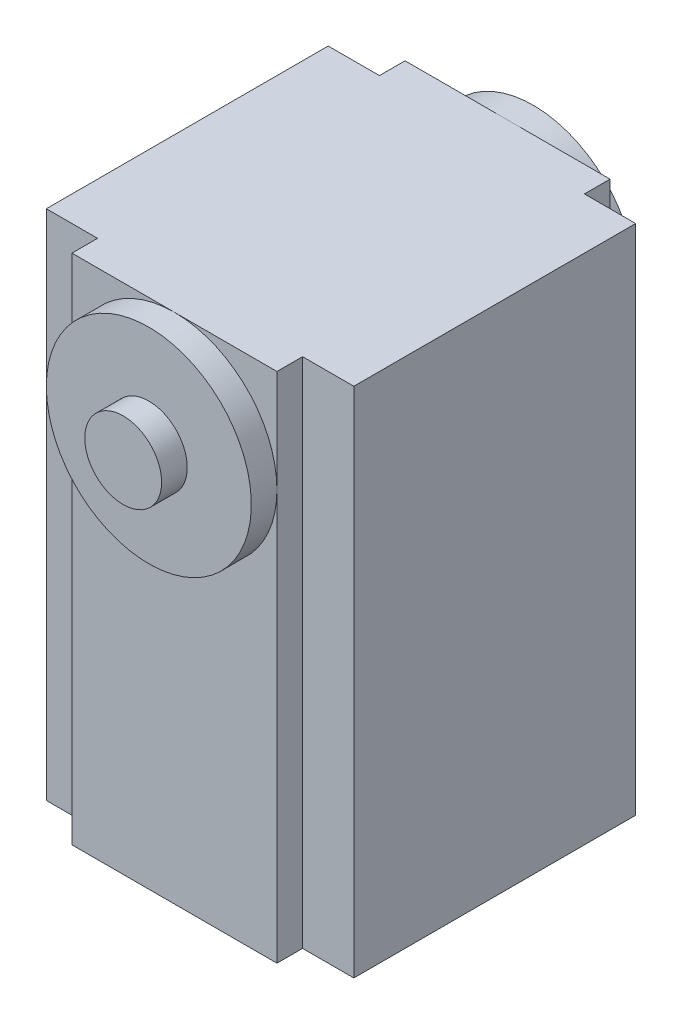
ISO-10303-21;
HEADER;
FILE_DESCRIPTION(('STEP AP214'),'2;1');
FILE_NAME('part.step','',(''),(''),'','','');
FILE_SCHEMA(('AUTOMOTIVE_DESIGN { 1 0 10303 214 1 1 1 1 }'));
ENDSEC;
DATA;
#1=APPLICATION_CONTEXT('core data for automotive mechanical design processes');
#2=APPLICATION_PROTOCOL_DEFINITION('international standard','automotive_design',2000,#1);
#3=PRODUCT_CONTEXT('',#1,'mechanical');
#4=PRODUCT('Part','Part','',(#3));
#5=PRODUCT_RELATED_PRODUCT_CATEGORY('part','',(#4));
#6=PRODUCT_DEFINITION_FORMATION('','',#4);
#7=PRODUCT_DEFINITION_CONTEXT('part definition',#1,'design');
#8=PRODUCT_DEFINITION('design','',#6,#7);
#9=PRODUCT_DEFINITION_SHAPE('','',#8);
#10=(LENGTH_UNIT() NAMED_UNIT(*) SI_UNIT(.MILLI.,.METRE.));
#11=(NAMED_UNIT(*) PLANE_ANGLE_UNIT() SI_UNIT($,.RADIAN.));
#12=(NAMED_UNIT(*) SI_UNIT($,.STERADIAN.) SOLID_ANGLE_UNIT());
#13=UNCERTAINTY_MEASURE_WITH_UNIT(LENGTH_MEASURE(1.E-05),#10,'distance_accuracy_value','');
#14=(GEOMETRIC_REPRESENTATION_CONTEXT(3) GLOBAL_UNCERTAINTY_ASSIGNED_CONTEXT((#13)) GLOBAL_UNIT_ASSIGNED_CONTEXT((#10,
#11,#12)) REPRESENTATION_CONTEXT('',''));
#15=CARTESIAN_POINT('',(0.,0.,0.));
#16=DIRECTION('',(0.,0.,1.));
#17=DIRECTION('',(1.,0.,0.));
#18=AXIS2_PLACEMENT_3D('',#15,#16,#17);
#19=CARTESIAN_POINT('',(-19.05,-31.75,41.275));
#20=DIRECTION('',(1.,0.,0.));
#21=DIRECTION('',(0.,0.,-1.));
#22=AXIS2_PLACEMENT_3D('',#19,#20,#21);
#23=PLANE('',#22);
#24=DIRECTION('',(0.,-1.,0.));
#25=VECTOR('',#24,1.);
#26=CARTESIAN_POINT('',(-19.05,31.75,3.175));
#27=LINE('',#26,#25);
#28=CARTESIAN_POINT('',(-19.05,31.75,3.175));
#29=VERTEX_POINT('',#28);
#30=CARTESIAN_POINT('',(-19.05,-31.75,3.175));
#31=VERTEX_POINT('',#30);
#32=EDGE_CURVE('E141',#29,#31,#27,.T.);
#33=ORIENTED_EDGE('',*,*,#32,.T.);
#34=DIRECTION('',(0.,0.,-1.));
#35=VECTOR('',#34,1.);
#36=CARTESIAN_POINT('',(-19.05,-31.75,41.275));
#37=LINE('',#36,#35);
#38=CARTESIAN_POINT('',(-19.05,-31.75,38.1));
#39=VERTEX_POINT('',#38);
#40=EDGE_CURVE('E37',#39,#31,#37,.T.);
#41=ORIENTED_EDGE('',*,*,#40,.F.);
#42=DIRECTION('',(0.,-1.,0.));
#43=VECTOR('',#42,1.);
#44=CARTESIAN_POINT('',(-19.05,31.75,38.1));
#45=LINE('',#44,#43);
#46=CARTESIAN_POINT('',(-19.05,31.75,38.1));
#47=VERTEX_POINT('',#46);
#48=EDGE_CURVE('E165',#47,#39,#45,.T.);
#49=ORIENTED_EDGE('',*,*,#48,.F.);
#50=DIRECTION('',(0.,0.,-1.));
#51=VECTOR('',#50,1.);
#52=CARTESIAN_POINT('',(-19.05,31.75,41.275));
#53=LINE('',#52,#51);
#54=EDGE_CURVE('E159',#47,#29,#53,.T.);
#55=ORIENTED_EDGE('',*,*,#54,.T.);
#56=EDGE_LOOP('',(#33,#41,#49,#55));
#57=FACE_BOUND('',#56,.T.);
#58=ADVANCED_FACE('F34',(#57),#23,.F.);
#59=CARTESIAN_POINT('',(19.05,-31.75,41.275));
#60=DIRECTION('',(0.,1.,0.));
#61=DIRECTION('',(-1.,0.,0.));
#62=AXIS2_PLACEMENT_3D('',#59,#60,#61);
#63=PLANE('',#62);
#64=DIRECTION('',(0.,0.,-1.));
#65=VECTOR('',#64,1.);
#66=CARTESIAN_POINT('',(-12.7,-31.75,3.175));
#67=LINE('',#66,#65);
#68=CARTESIAN_POINT('',(-12.7,-31.75,3.175));
#69=VERTEX_POINT('',#68);
#70=CARTESIAN_POINT('',(-12.7,-31.75,0.));
#71=VERTEX_POINT('',#70);
#72=EDGE_CURVE('E283',#69,#71,#67,.T.);
#73=ORIENTED_EDGE('',*,*,#72,.T.);
#74=DIRECTION('',(1.,0.,0.));
#75=VECTOR('',#74,1.);
#76=CARTESIAN_POINT('',(19.05,-31.75,0.));
#77=LINE('',#76,#75);
#78=CARTESIAN_POINT('',(12.7,-31.75,0.));
#79=VERTEX_POINT('',#78);
#80=EDGE_CURVE('E247',#71,#79,#77,.T.);
#81=ORIENTED_EDGE('',*,*,#80,.T.);
#82=DIRECTION('',(0.,0.,-1.));
#83=VECTOR('',#82,1.);
#84=CARTESIAN_POINT('',(12.7,-31.75,3.175));
#85=LINE('',#84,#83);
#86=CARTESIAN_POINT('',(12.7,-31.75,3.175));
#87=VERTEX_POINT('',#86);
#88=EDGE_CURVE('E293',#87,#79,#85,.T.);
#89=ORIENTED_EDGE('',*,*,#88,.F.);
#90=DIRECTION('',(1.,0.,0.));
#91=VECTOR('',#90,1.);
#92=CARTESIAN_POINT('',(19.05,-31.75,3.175));
#93=LINE('',#92,#91);
#94=CARTESIAN_POINT('',(19.05,-31.75,3.175));
#95=VERTEX_POINT('',#94);
#96=EDGE_CURVE('E287',#87,#95,#93,.T.);
#97=ORIENTED_EDGE('',*,*,#96,.T.);
#98=DIRECTION('',(0.,0.,-1.));
#99=VECTOR('',#98,1.);
#100=CARTESIAN_POINT('',(19.05,-31.75,41.275));
#101=LINE('',#100,#99);
#102=CARTESIAN_POINT('',(19.05,-31.75,38.1));
#103=VERTEX_POINT('',#102);
#104=EDGE_CURVE('E170',#103,#95,#101,.T.);
#105=ORIENTED_EDGE('',*,*,#104,.F.);
#106=DIRECTION('',(1.,0.,0.));
#107=VECTOR('',#106,1.);
#108=CARTESIAN_POINT('',(19.05,-31.75,38.1));
#109=LINE('',#108,#107);
#110=CARTESIAN_POINT('',(12.7,-31.75,38.1));
#111=VERTEX_POINT('',#110);
#112=EDGE_CURVE('E218',#111,#103,#109,.T.);
#113=ORIENTED_EDGE('',*,*,#112,.F.);
#114=DIRECTION('',(0.,0.,1.));
#115=VECTOR('',#114,1.);
#116=CARTESIAN_POINT('',(12.7,-31.75,38.1));
#117=LINE('',#116,#115);
#118=CARTESIAN_POINT('',(12.7,-31.75,41.275));
#119=VERTEX_POINT('',#118);
#120=EDGE_CURVE('E223',#111,#119,#117,.T.);
#121=ORIENTED_EDGE('',*,*,#120,.T.);
#122=DIRECTION('',(1.,0.,0.));
#123=VECTOR('',#122,1.);
#124=CARTESIAN_POINT('',(19.05,-31.75,41.275));
#125=LINE('',#124,#123);
#126=CARTESIAN_POINT('',(-12.7,-31.75,41.275));
#127=VERTEX_POINT('',#126);
#128=EDGE_CURVE('E252',#127,#119,#125,.T.);
#129=ORIENTED_EDGE('',*,*,#128,.F.);
#130=DIRECTION('',(0.,0.,1.));
#131=VECTOR('',#130,1.);
#132=CARTESIAN_POINT('',(-12.7,-31.75,38.1));
#133=LINE('',#132,#131);
#134=CARTESIAN_POINT('',(-12.7,-31.75,38.1));
#135=VERTEX_POINT('',#134);
#136=EDGE_CURVE('E190',#135,#127,#133,.T.);
#137=ORIENTED_EDGE('',*,*,#136,.F.);
#138=DIRECTION('',(1.,0.,0.));
#139=VECTOR('',#138,1.);
#140=CARTESIAN_POINT('',(-19.05,-31.75,38.1));
#141=LINE('',#140,#139);
#142=EDGE_CURVE('E188',#39,#135,#141,.T.);
#143=ORIENTED_EDGE('',*,*,#142,.F.);
#144=ORIENTED_EDGE('',*,*,#40,.T.);
#145=DIRECTION('',(1.,0.,0.));
#146=VECTOR('',#145,1.);
#147=CARTESIAN_POINT('',(-19.05,-31.75,3.175));
#148=LINE('',#147,#146);
#149=EDGE_CURVE('E148',#31,#69,#148,.T.);
#150=ORIENTED_EDGE('',*,*,#149,.T.);
#151=EDGE_LOOP('',(#73,#81,#89,#97,#105,#113,#121,#129,#137,#143,#144,#150));
#152=FACE_BOUND('',#151,.T.);
#153=ADVANCED_FACE('F185',(#152),#63,.F.);
#154=CARTESIAN_POINT('',(19.05,31.75,41.275));
#155=DIRECTION('',(0.,-1.,0.));
#156=DIRECTION('',(1.,0.,0.));
#157=AXIS2_PLACEMENT_3D('',#154,#155,#156);
#158=PLANE('',#157);
#159=DIRECTION('',(0.,0.,-1.));
#160=VECTOR('',#159,1.);
#161=CARTESIAN_POINT('',(-12.7,31.75,3.175));
#162=LINE('',#161,#160);
#163=CARTESIAN_POINT('',(-12.7,31.75,3.175));
#164=VERTEX_POINT('',#163);
#165=CARTESIAN_POINT('',(-12.7,31.75,0.));
#166=VERTEX_POINT('',#165);
#167=EDGE_CURVE('E161',#164,#166,#162,.T.);
#168=ORIENTED_EDGE('',*,*,#167,.F.);
#169=DIRECTION('',(-1.,0.,0.));
#170=VECTOR('',#169,1.);
#171=CARTESIAN_POINT('',(-19.05,31.75,3.175));
#172=LINE('',#171,#170);
#173=EDGE_CURVE('E145',#164,#29,#172,.T.);
#174=ORIENTED_EDGE('',*,*,#173,.T.);
#175=ORIENTED_EDGE('',*,*,#54,.F.);
#176=DIRECTION('',(-1.,0.,0.));
#177=VECTOR('',#176,1.);
#178=CARTESIAN_POINT('',(-19.05,31.75,38.1));
#179=LINE('',#178,#177);
#180=CARTESIAN_POINT('',(-12.7,31.75,38.1));
#181=VERTEX_POINT('',#180);
#182=EDGE_CURVE('E195',#181,#47,#179,.T.);
#183=ORIENTED_EDGE('',*,*,#182,.F.);
#184=DIRECTION('',(0.,0.,1.));
#185=VECTOR('',#184,1.);
#186=CARTESIAN_POINT('',(-12.7,31.75,38.1));
#187=LINE('',#186,#185);
#188=CARTESIAN_POINT('',(-12.7,31.75,41.275));
#189=VERTEX_POINT('',#188);
#190=EDGE_CURVE('E204',#181,#189,#187,.T.);
#191=ORIENTED_EDGE('',*,*,#190,.T.);
#192=DIRECTION('',(-1.,0.,0.));
#193=VECTOR('',#192,1.);
#194=CARTESIAN_POINT('',(19.05,31.75,41.275));
#195=LINE('',#194,#193);
#196=CARTESIAN_POINT('',(0.,31.75,41.275));
#197=VERTEX_POINT('',#196);
#198=EDGE_CURVE('E172',#197,#189,#195,.T.);
#199=ORIENTED_EDGE('',*,*,#198,.F.);
#200=CARTESIAN_POINT('',(12.7,31.75,41.275));
#201=VERTEX_POINT('',#200);
#202=EDGE_CURVE('E167',#201,#197,#195,.T.);
#203=ORIENTED_EDGE('',*,*,#202,.F.);
#204=DIRECTION('',(0.,0.,1.));
#205=VECTOR('',#204,1.);
#206=CARTESIAN_POINT('',(12.7,31.75,38.1));
#207=LINE('',#206,#205);
#208=CARTESIAN_POINT('',(12.7,31.75,38.1));
#209=VERTEX_POINT('',#208);
#210=EDGE_CURVE('E220',#209,#201,#207,.T.);
#211=ORIENTED_EDGE('',*,*,#210,.F.);
#212=DIRECTION('',(-1.,0.,0.));
#213=VECTOR('',#212,1.);
#214=CARTESIAN_POINT('',(19.05,31.75,38.1));
#215=LINE('',#214,#213);
#216=CARTESIAN_POINT('',(19.05,31.75,38.1));
#217=VERTEX_POINT('',#216);
#218=EDGE_CURVE('E211',#217,#209,#215,.T.);
#219=ORIENTED_EDGE('',*,*,#218,.F.);
#220=DIRECTION('',(0.,0.,-1.));
#221=VECTOR('',#220,1.);
#222=CARTESIAN_POINT('',(19.05,31.75,41.275));
#223=LINE('',#222,#221);
#224=CARTESIAN_POINT('',(19.05,31.75,3.175));
#225=VERTEX_POINT('',#224);
#226=EDGE_CURVE('E166',#217,#225,#223,.T.);
#227=ORIENTED_EDGE('',*,*,#226,.T.);
#228=DIRECTION('',(-1.,0.,0.));
#229=VECTOR('',#228,1.);
#230=CARTESIAN_POINT('',(19.05,31.75,3.175));
#231=LINE('',#230,#229);
#232=CARTESIAN_POINT('',(12.7,31.75,3.175));
#233=VERTEX_POINT('',#232);
#234=EDGE_CURVE('E292',#225,#233,#231,.T.);
#235=ORIENTED_EDGE('',*,*,#234,.T.);
#236=DIRECTION('',(0.,0.,-1.));
#237=VECTOR('',#236,1.);
#238=CARTESIAN_POINT('',(12.7,31.75,3.175));
#239=LINE('',#238,#237);
#240=CARTESIAN_POINT('',(12.7,31.75,0.));
#241=VERTEX_POINT('',#240);
#242=EDGE_CURVE('E263',#233,#241,#239,.T.);
#243=ORIENTED_EDGE('',*,*,#242,.T.);
#244=DIRECTION('',(-1.,0.,0.));
#245=VECTOR('',#244,1.);
#246=CARTESIAN_POINT('',(19.05,31.75,0.));
#247=LINE('',#246,#245);
#248=CARTESIAN_POINT('',(0.,31.75,0.));
#249=VERTEX_POINT('',#248);
#250=EDGE_CURVE('E175',#241,#249,#247,.T.);
#251=ORIENTED_EDGE('',*,*,#250,.T.);
#252=EDGE_CURVE('E255',#249,#166,#247,.T.);
#253=ORIENTED_EDGE('',*,*,#252,.T.);
#254=EDGE_LOOP('',(#168,#174,#175,#183,#191,#199,#203,#211,#219,#227,#235,#243,#251,#253));
#255=FACE_BOUND('',#254,.T.);
#256=ADVANCED_FACE('F157',(#255),#158,.F.);
#257=CARTESIAN_POINT('',(0.,0.,0.));
#258=DIRECTION('',(0.,0.,1.));
#259=DIRECTION('',(1.,0.,0.));
#260=AXIS2_PLACEMENT_3D('',#257,#258,#259);
#261=PLANE('',#260);
#262=DIRECTION('',(0.,1.,0.));
#263=VECTOR('',#262,1.);
#264=CARTESIAN_POINT('',(-12.7,31.75,0.));
#265=LINE('',#264,#263);
#266=CARTESIAN_POINT('',(-12.7,19.05,0.));
#267=VERTEX_POINT('',#266);
#268=EDGE_CURVE('E49',#267,#166,#265,.T.);
#269=ORIENTED_EDGE('',*,*,#268,.T.);
#270=ORIENTED_EDGE('',*,*,#252,.F.);
#271=CARTESIAN_POINT('',(0.,19.05,0.));
#272=DIRECTION('',(0.,0.,-1.));
#273=DIRECTION('',(-1.,0.,0.));
#274=AXIS2_PLACEMENT_3D('',#271,#272,#273);
#275=CIRCLE('',#274,12.7);
#276=EDGE_CURVE('E242',#267,#249,#275,.T.);
#277=ORIENTED_EDGE('',*,*,#276,.F.);
#278=EDGE_LOOP('',(#269,#270,#277));
#279=FACE_BOUND('',#278,.T.);
#280=ADVANCED_FACE('F272',(#279),#261,.F.);
#281=EDGE_CURVE('E153',#71,#267,#265,.T.);
#282=ORIENTED_EDGE('',*,*,#281,.T.);
#283=CARTESIAN_POINT('',(12.7,19.05,0.));
#284=VERTEX_POINT('',#283);
#285=EDGE_CURVE('E251',#284,#267,#275,.T.);
#286=ORIENTED_EDGE('',*,*,#285,.F.);
#287=DIRECTION('',(0.,-1.,0.));
#288=VECTOR('',#287,1.);
#289=CARTESIAN_POINT('',(12.7,31.75,0.));
#290=LINE('',#289,#288);
#291=EDGE_CURVE('E57',#284,#79,#290,.T.);
#292=ORIENTED_EDGE('',*,*,#291,.T.);
#293=ORIENTED_EDGE('',*,*,#80,.F.);
#294=EDGE_LOOP('',(#282,#286,#292,#293));
#295=FACE_BOUND('',#294,.T.);
#296=ADVANCED_FACE('F278',(#295),#261,.F.);
#297=EDGE_CURVE('E274',#241,#284,#290,.T.);
#298=ORIENTED_EDGE('',*,*,#297,.T.);
#299=EDGE_CURVE('E248',#249,#284,#275,.T.);
#300=ORIENTED_EDGE('',*,*,#299,.F.);
#301=ORIENTED_EDGE('',*,*,#250,.F.);
#302=EDGE_LOOP('',(#298,#300,#301));
#303=FACE_BOUND('',#302,.T.);
#304=ADVANCED_FACE('F273',(#303),#261,.F.);
#305=CARTESIAN_POINT('',(0.,0.,41.275));
#306=DIRECTION('',(0.,0.,1.));
#307=DIRECTION('',(1.,0.,0.));
#308=AXIS2_PLACEMENT_3D('',#305,#306,#307);
#309=PLANE('',#308);
#310=DIRECTION('',(0.,1.,0.));
#311=VECTOR('',#310,1.);
#312=CARTESIAN_POINT('',(-12.7,31.75,41.275));
#313=LINE('',#312,#311);
#314=CARTESIAN_POINT('',(-12.7,19.05,41.275));
#315=VERTEX_POINT('',#314);
#316=EDGE_CURVE('E197',#127,#315,#313,.T.);
#317=ORIENTED_EDGE('',*,*,#316,.F.);
#318=ORIENTED_EDGE('',*,*,#128,.T.);
#319=DIRECTION('',(0.,-1.,0.));
#320=VECTOR('',#319,1.);
#321=CARTESIAN_POINT('',(12.7,31.75,41.275));
#322=LINE('',#321,#320);
#323=CARTESIAN_POINT('',(12.7,19.05,41.275));
#324=VERTEX_POINT('',#323);
#325=EDGE_CURVE('E222',#324,#119,#322,.T.);
#326=ORIENTED_EDGE('',*,*,#325,.F.);
#327=CARTESIAN_POINT('',(0.,19.05,41.275));
#328=DIRECTION('',(0.,0.,-1.));
#329=DIRECTION('',(-1.,0.,0.));
#330=AXIS2_PLACEMENT_3D('',#327,#328,#329);
#331=CIRCLE('',#330,12.7);
#332=EDGE_CURVE('E240',#324,#315,#331,.T.);
#333=ORIENTED_EDGE('',*,*,#332,.T.);
#334=EDGE_LOOP('',(#317,#318,#326,#333));
#335=FACE_BOUND('',#334,.T.);
#336=ADVANCED_FACE('F312',(#335),#309,.T.);
#337=EDGE_CURVE('E212',#201,#324,#322,.T.);
#338=ORIENTED_EDGE('',*,*,#337,.F.);
#339=ORIENTED_EDGE('',*,*,#202,.T.);
#340=EDGE_CURVE('E237',#197,#324,#331,.T.);
#341=ORIENTED_EDGE('',*,*,#340,.T.);
#342=EDGE_LOOP('',(#338,#339,#341));
#343=FACE_BOUND('',#342,.T.);
#344=ADVANCED_FACE('F348',(#343),#309,.T.);
#345=CARTESIAN_POINT('',(19.05,-31.75,41.275));
#346=DIRECTION('',(-1.,0.,0.));
#347=DIRECTION('',(0.,-1.,0.));
#348=AXIS2_PLACEMENT_3D('',#345,#346,#347);
#349=PLANE('',#348);
#350=ORIENTED_EDGE('',*,*,#104,.T.);
#351=DIRECTION('',(0.,1.,0.));
#352=VECTOR('',#351,1.);
#353=CARTESIAN_POINT('',(19.05,31.75,3.175));
#354=LINE('',#353,#352);
#355=EDGE_CURVE('E275',#95,#225,#354,.T.);
#356=ORIENTED_EDGE('',*,*,#355,.T.);
#357=ORIENTED_EDGE('',*,*,#226,.F.);
#358=DIRECTION('',(0.,1.,0.));
#359=VECTOR('',#358,1.);
#360=CARTESIAN_POINT('',(19.05,31.75,38.1));
#361=LINE('',#360,#359);
#362=EDGE_CURVE('E209',#103,#217,#361,.T.);
#363=ORIENTED_EDGE('',*,*,#362,.F.);
#364=EDGE_LOOP('',(#350,#356,#357,#363));
#365=FACE_BOUND('',#364,.T.);
#366=ADVANCED_FACE('F302',(#365),#349,.F.);
#367=EDGE_CURVE('E203',#315,#189,#313,.T.);
#368=ORIENTED_EDGE('',*,*,#367,.F.);
#369=EDGE_CURVE('E230',#315,#197,#331,.T.);
#370=ORIENTED_EDGE('',*,*,#369,.T.);
#371=ORIENTED_EDGE('',*,*,#198,.T.);
#372=EDGE_LOOP('',(#368,#370,#371));
#373=FACE_BOUND('',#372,.T.);
#374=ADVANCED_FACE('F322',(#373),#309,.T.);
#375=CARTESIAN_POINT('',(0.,19.05,-3.175));
#376=DIRECTION('',(0.,0.,1.));
#377=DIRECTION('',(1.,0.,0.));
#378=AXIS2_PLACEMENT_3D('',#375,#376,#377);
#379=CYLINDRICAL_SURFACE('',#378,12.7);
#380=CARTESIAN_POINT('',(0.,19.05,-3.175));
#381=DIRECTION('',(0.,0.,-1.));
#382=DIRECTION('',(-1.,0.,0.));
#383=AXIS2_PLACEMENT_3D('',#380,#381,#382);
#384=CIRCLE('',#383,12.7);
#385=CARTESIAN_POINT('',(-12.7,19.05,-3.175));
#386=VERTEX_POINT('',#385);
#387=EDGE_CURVE('E244',#386,#386,#384,.T.);
#388=ORIENTED_EDGE('',*,*,#387,.F.);
#389=EDGE_LOOP('',(#388));
#390=FACE_BOUND('',#389,.T.);
#391=ORIENTED_EDGE('',*,*,#299,.T.);
#392=ORIENTED_EDGE('',*,*,#285,.T.);
#393=ORIENTED_EDGE('',*,*,#276,.T.);
#394=EDGE_LOOP('',(#391,#392,#393));
#395=FACE_BOUND('',#394,.T.);
#396=ADVANCED_FACE('F269',(#390,#395),#379,.T.);
#397=CARTESIAN_POINT('',(0.,19.05,-3.175));
#398=DIRECTION('',(0.,0.,-1.));
#399=DIRECTION('',(-1.,0.,0.));
#400=AXIS2_PLACEMENT_3D('',#397,#398,#399);
#401=PLANE('',#400);
#402=CARTESIAN_POINT('',(0.,19.05,-3.175));
#403=DIRECTION('',(0.,0.,-1.));
#404=DIRECTION('',(-1.,0.,0.));
#405=AXIS2_PLACEMENT_3D('',#402,#403,#404);
#406=CIRCLE('',#405,4.7625);
#407=CARTESIAN_POINT('',(-4.7625,19.05,-3.175));
#408=VERTEX_POINT('',#407);
#409=EDGE_CURVE('E11',#408,#408,#406,.T.);
#410=ORIENTED_EDGE('',*,*,#409,.F.);
#411=EDGE_LOOP('',(#410));
#412=FACE_BOUND('',#411,.T.);
#413=ORIENTED_EDGE('',*,*,#387,.T.);
#414=EDGE_LOOP('',(#413));
#415=FACE_BOUND('',#414,.T.);
#416=ADVANCED_FACE('F356',(#412,#415),#401,.T.);
#417=CARTESIAN_POINT('',(0.,19.05,-6.35));
#418=DIRECTION('',(0.,0.,1.));
#419=DIRECTION('',(1.,0.,0.));
#420=AXIS2_PLACEMENT_3D('',#417,#418,#419);
#421=CYLINDRICAL_SURFACE('',#420,4.7625);
#422=CARTESIAN_POINT('',(0.,19.05,-6.35));
#423=DIRECTION('',(0.,0.,-1.));
#424=DIRECTION('',(-1.,0.,0.));
#425=AXIS2_PLACEMENT_3D('',#422,#423,#424);
#426=CIRCLE('',#425,4.7625);
#427=CARTESIAN_POINT('',(-4.7625,19.05,-6.35));
#428=VERTEX_POINT('',#427);
#429=EDGE_CURVE('E236',#428,#428,#426,.T.);
#430=ORIENTED_EDGE('',*,*,#429,.F.);
#431=EDGE_LOOP('',(#430));
#432=FACE_BOUND('',#431,.T.);
#433=ORIENTED_EDGE('',*,*,#409,.T.);
#434=EDGE_LOOP('',(#433));
#435=FACE_BOUND('',#434,.T.);
#436=ADVANCED_FACE('F360',(#432,#435),#421,.T.);
#437=CARTESIAN_POINT('',(0.,19.05,-6.35));
#438=DIRECTION('',(0.,0.,-1.));
#439=DIRECTION('',(-1.,0.,0.));
#440=AXIS2_PLACEMENT_3D('',#437,#438,#439);
#441=PLANE('',#440);
#442=ORIENTED_EDGE('',*,*,#429,.T.);
#443=EDGE_LOOP('',(#442));
#444=FACE_BOUND('',#443,.T.);
#445=ADVANCED_FACE('F364',(#444),#441,.T.);
#446=CARTESIAN_POINT('',(0.,19.05,44.45));
#447=DIRECTION('',(0.,0.,-1.));
#448=DIRECTION('',(-1.,0.,0.));
#449=AXIS2_PLACEMENT_3D('',#446,#447,#448);
#450=CYLINDRICAL_SURFACE('',#449,12.7);
#451=CARTESIAN_POINT('',(0.,19.05,44.45));
#452=DIRECTION('',(0.,0.,-1.));
#453=DIRECTION('',(-1.,0.,0.));
#454=AXIS2_PLACEMENT_3D('',#451,#452,#453);
#455=CIRCLE('',#454,12.7);
#456=CARTESIAN_POINT('',(-12.7,19.05,44.45));
#457=VERTEX_POINT('',#456);
#458=EDGE_CURVE('E233',#457,#457,#455,.T.);
#459=ORIENTED_EDGE('',*,*,#458,.T.);
#460=EDGE_LOOP('',(#459));
#461=FACE_BOUND('',#460,.T.);
#462=ORIENTED_EDGE('',*,*,#340,.F.);
#463=ORIENTED_EDGE('',*,*,#369,.F.);
#464=ORIENTED_EDGE('',*,*,#332,.F.);
#465=EDGE_LOOP('',(#462,#463,#464));
#466=FACE_BOUND('',#465,.T.);
#467=ADVANCED_FACE('F326',(#461,#466),#450,.T.);
#468=CARTESIAN_POINT('',(0.,19.05,44.45));
#469=DIRECTION('',(0.,0.,1.));
#470=DIRECTION('',(-1.,0.,0.));
#471=AXIS2_PLACEMENT_3D('',#468,#469,#470);
#472=PLANE('',#471);
#473=CARTESIAN_POINT('',(0.,19.05,44.45));
#474=DIRECTION('',(0.,0.,-1.));
#475=DIRECTION('',(-1.,0.,0.));
#476=AXIS2_PLACEMENT_3D('',#473,#474,#475);
#477=CIRCLE('',#476,4.7625);
#478=CARTESIAN_POINT('',(-4.7625,19.05,44.45));
#479=VERTEX_POINT('',#478);
#480=EDGE_CURVE('E207',#479,#479,#477,.T.);
#481=ORIENTED_EDGE('',*,*,#480,.T.);
#482=EDGE_LOOP('',(#481));
#483=FACE_BOUND('',#482,.T.);
#484=ORIENTED_EDGE('',*,*,#458,.F.);
#485=EDGE_LOOP('',(#484));
#486=FACE_BOUND('',#485,.T.);
#487=ADVANCED_FACE('F371',(#483,#486),#472,.T.);
#488=CARTESIAN_POINT('',(0.,19.05,47.625));
#489=DIRECTION('',(0.,0.,-1.));
#490=DIRECTION('',(-1.,0.,0.));
#491=AXIS2_PLACEMENT_3D('',#488,#489,#490);
#492=CYLINDRICAL_SURFACE('',#491,4.7625);
#493=CARTESIAN_POINT('',(0.,19.05,47.625));
#494=DIRECTION('',(0.,0.,-1.));
#495=DIRECTION('',(-1.,0.,0.));
#496=AXIS2_PLACEMENT_3D('',#493,#494,#495);
#497=CIRCLE('',#496,4.7625);
#498=CARTESIAN_POINT('',(-4.7625,19.05,47.625));
#499=VERTEX_POINT('',#498);
#500=EDGE_CURVE('E227',#499,#499,#497,.T.);
#501=ORIENTED_EDGE('',*,*,#500,.T.);
#502=EDGE_LOOP('',(#501));
#503=FACE_BOUND('',#502,.T.);
#504=ORIENTED_EDGE('',*,*,#480,.F.);
#505=EDGE_LOOP('',(#504));
#506=FACE_BOUND('',#505,.T.);
#507=ADVANCED_FACE('F375',(#503,#506),#492,.T.);
#508=CARTESIAN_POINT('',(0.,19.05,47.625));
#509=DIRECTION('',(0.,0.,1.));
#510=DIRECTION('',(-1.,0.,0.));
#511=AXIS2_PLACEMENT_3D('',#508,#509,#510);
#512=PLANE('',#511);
#513=ORIENTED_EDGE('',*,*,#500,.F.);
#514=EDGE_LOOP('',(#513));
#515=FACE_BOUND('',#514,.T.);
#516=ADVANCED_FACE('F379',(#515),#512,.T.);
#517=CARTESIAN_POINT('',(12.7,31.75,38.1));
#518=DIRECTION('',(-1.,0.,0.));
#519=DIRECTION('',(0.,-1.,0.));
#520=AXIS2_PLACEMENT_3D('',#517,#518,#519);
#521=PLANE('',#520);
#522=ORIENTED_EDGE('',*,*,#337,.T.);
#523=ORIENTED_EDGE('',*,*,#325,.T.);
#524=ORIENTED_EDGE('',*,*,#120,.F.);
#525=DIRECTION('',(0.,-1.,0.));
#526=VECTOR('',#525,1.);
#527=CARTESIAN_POINT('',(12.7,31.75,38.1));
#528=LINE('',#527,#526);
#529=EDGE_CURVE('E215',#209,#111,#528,.T.);
#530=ORIENTED_EDGE('',*,*,#529,.F.);
#531=ORIENTED_EDGE('',*,*,#210,.T.);
#532=EDGE_LOOP('',(#522,#523,#524,#530,#531));
#533=FACE_BOUND('',#532,.T.);
#534=ADVANCED_FACE('F383',(#533),#521,.F.);
#535=CARTESIAN_POINT('',(0.,0.,38.1));
#536=DIRECTION('',(0.,0.,-1.));
#537=DIRECTION('',(-1.,0.,0.));
#538=AXIS2_PLACEMENT_3D('',#535,#536,#537);
#539=PLANE('',#538);
#540=ORIENTED_EDGE('',*,*,#362,.T.);
#541=ORIENTED_EDGE('',*,*,#218,.T.);
#542=ORIENTED_EDGE('',*,*,#529,.T.);
#543=ORIENTED_EDGE('',*,*,#112,.T.);
#544=EDGE_LOOP('',(#540,#541,#542,#543));
#545=FACE_BOUND('',#544,.T.);
#546=ADVANCED_FACE('F307',(#545),#539,.F.);
#547=CARTESIAN_POINT('',(-12.7,31.75,38.1));
#548=DIRECTION('',(1.,0.,0.));
#549=DIRECTION('',(0.,1.,0.));
#550=AXIS2_PLACEMENT_3D('',#547,#548,#549);
#551=PLANE('',#550);
#552=ORIENTED_EDGE('',*,*,#316,.T.);
#553=ORIENTED_EDGE('',*,*,#367,.T.);
#554=ORIENTED_EDGE('',*,*,#190,.F.);
#555=DIRECTION('',(0.,1.,0.));
#556=VECTOR('',#555,1.);
#557=CARTESIAN_POINT('',(-12.7,31.75,38.1));
#558=LINE('',#557,#556);
#559=EDGE_CURVE('E193',#135,#181,#558,.T.);
#560=ORIENTED_EDGE('',*,*,#559,.F.);
#561=ORIENTED_EDGE('',*,*,#136,.T.);
#562=EDGE_LOOP('',(#552,#553,#554,#560,#561));
#563=FACE_BOUND('',#562,.T.);
#564=ADVANCED_FACE('F317',(#563),#551,.F.);
#565=CARTESIAN_POINT('',(0.,0.,38.1));
#566=DIRECTION('',(0.,0.,1.));
#567=DIRECTION('',(1.,0.,0.));
#568=AXIS2_PLACEMENT_3D('',#565,#566,#567);
#569=PLANE('',#568);
#570=ORIENTED_EDGE('',*,*,#48,.T.);
#571=ORIENTED_EDGE('',*,*,#142,.T.);
#572=ORIENTED_EDGE('',*,*,#559,.T.);
#573=ORIENTED_EDGE('',*,*,#182,.T.);
#574=EDGE_LOOP('',(#570,#571,#572,#573));
#575=FACE_BOUND('',#574,.T.);
#576=ADVANCED_FACE('F329',(#575),#569,.T.);
#577=CARTESIAN_POINT('',(12.7,31.75,3.175));
#578=DIRECTION('',(1.,0.,0.));
#579=DIRECTION('',(0.,1.,0.));
#580=AXIS2_PLACEMENT_3D('',#577,#578,#579);
#581=PLANE('',#580);
#582=ORIENTED_EDGE('',*,*,#297,.F.);
#583=ORIENTED_EDGE('',*,*,#242,.F.);
#584=DIRECTION('',(0.,-1.,0.));
#585=VECTOR('',#584,1.);
#586=CARTESIAN_POINT('',(12.7,31.75,3.175));
#587=LINE('',#586,#585);
#588=EDGE_CURVE('E290',#233,#87,#587,.T.);
#589=ORIENTED_EDGE('',*,*,#588,.T.);
#590=ORIENTED_EDGE('',*,*,#88,.T.);
#591=ORIENTED_EDGE('',*,*,#291,.F.);
#592=EDGE_LOOP('',(#582,#583,#589,#590,#591));
#593=FACE_BOUND('',#592,.T.);
#594=ADVANCED_FACE('F295',(#593),#581,.T.);
#595=CARTESIAN_POINT('',(0.,0.,3.175));
#596=DIRECTION('',(0.,0.,1.));
#597=DIRECTION('',(-1.,0.,0.));
#598=AXIS2_PLACEMENT_3D('',#595,#596,#597);
#599=PLANE('',#598);
#600=ORIENTED_EDGE('',*,*,#355,.F.);
#601=ORIENTED_EDGE('',*,*,#96,.F.);
#602=ORIENTED_EDGE('',*,*,#588,.F.);
#603=ORIENTED_EDGE('',*,*,#234,.F.);
#604=EDGE_LOOP('',(#600,#601,#602,#603));
#605=FACE_BOUND('',#604,.T.);
#606=ADVANCED_FACE('F300',(#605),#599,.F.);
#607=CARTESIAN_POINT('',(-12.7,31.75,3.175));
#608=DIRECTION('',(-1.,0.,0.));
#609=DIRECTION('',(0.,-1.,0.));
#610=AXIS2_PLACEMENT_3D('',#607,#608,#609);
#611=PLANE('',#610);
#612=ORIENTED_EDGE('',*,*,#281,.F.);
#613=ORIENTED_EDGE('',*,*,#72,.F.);
#614=DIRECTION('',(0.,1.,0.));
#615=VECTOR('',#614,1.);
#616=CARTESIAN_POINT('',(-12.7,31.75,3.175));
#617=LINE('',#616,#615);
#618=EDGE_CURVE('E162',#69,#164,#617,.T.);
#619=ORIENTED_EDGE('',*,*,#618,.T.);
#620=ORIENTED_EDGE('',*,*,#167,.T.);
#621=ORIENTED_EDGE('',*,*,#268,.F.);
#622=EDGE_LOOP('',(#612,#613,#619,#620,#621));
#623=FACE_BOUND('',#622,.T.);
#624=ADVANCED_FACE('F465',(#623),#611,.T.);
#625=CARTESIAN_POINT('',(0.,0.,3.175));
#626=DIRECTION('',(0.,0.,-1.));
#627=DIRECTION('',(1.,0.,0.));
#628=AXIS2_PLACEMENT_3D('',#625,#626,#627);
#629=PLANE('',#628);
#630=ORIENTED_EDGE('',*,*,#32,.F.);
#631=ORIENTED_EDGE('',*,*,#173,.F.);
#632=ORIENTED_EDGE('',*,*,#618,.F.);
#633=ORIENTED_EDGE('',*,*,#149,.F.);
#634=EDGE_LOOP('',(#630,#631,#632,#633));
#635=FACE_BOUND('',#634,.T.);
#636=ADVANCED_FACE('F143',(#635),#629,.T.);
#637=CLOSED_SHELL('',(#58,#153,#256,#280,#296,#304,#336,#344,#366,#374,#396,#416,#436,#445,#467,
#487,#507,#516,#534,#546,#564,#576,#594,#606,#624,#636));
#638=MANIFOLD_SOLID_BREP('B2',#637);
#639=ADVANCED_BREP_SHAPE_REPRESENTATION('',(#18,#638),#14);
#640=SHAPE_DEFINITION_REPRESENTATION(#9,#639);
ENDSEC;
END-ISO-10303-21;
